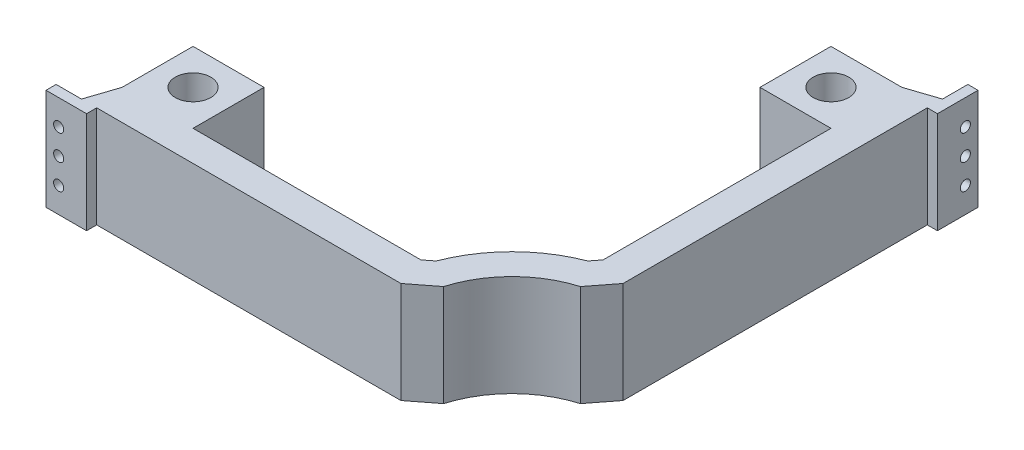
ISO-10303-21;
HEADER;
FILE_DESCRIPTION(('STEP AP214'),'2;1');
FILE_NAME('part.step','',(''),(''),'','','');
FILE_SCHEMA(('AUTOMOTIVE_DESIGN { 1 0 10303 214 1 1 1 1 }'));
ENDSEC;
DATA;
#1=APPLICATION_CONTEXT('core data for automotive mechanical design processes');
#2=APPLICATION_PROTOCOL_DEFINITION('international standard','automotive_design',2000,#1);
#3=PRODUCT_CONTEXT('',#1,'mechanical');
#4=PRODUCT('Part','Part','',(#3));
#5=PRODUCT_RELATED_PRODUCT_CATEGORY('part','',(#4));
#6=PRODUCT_DEFINITION_FORMATION('','',#4);
#7=PRODUCT_DEFINITION_CONTEXT('part definition',#1,'design');
#8=PRODUCT_DEFINITION('design','',#6,#7);
#9=PRODUCT_DEFINITION_SHAPE('','',#8);
#10=(LENGTH_UNIT() NAMED_UNIT(*) SI_UNIT(.MILLI.,.METRE.));
#11=(NAMED_UNIT(*) PLANE_ANGLE_UNIT() SI_UNIT($,.RADIAN.));
#12=(NAMED_UNIT(*) SI_UNIT($,.STERADIAN.) SOLID_ANGLE_UNIT());
#13=UNCERTAINTY_MEASURE_WITH_UNIT(LENGTH_MEASURE(1.E-05),#10,'distance_accuracy_value','');
#14=(GEOMETRIC_REPRESENTATION_CONTEXT(3) GLOBAL_UNCERTAINTY_ASSIGNED_CONTEXT((#13)) GLOBAL_UNIT_ASSIGNED_CONTEXT((#10,
#11,#12)) REPRESENTATION_CONTEXT('',''));
#15=CARTESIAN_POINT('',(0.,0.,0.));
#16=DIRECTION('',(0.,0.,1.));
#17=DIRECTION('',(1.,0.,0.));
#18=AXIS2_PLACEMENT_3D('',#15,#16,#17);
#19=CARTESIAN_POINT('',(75.2748115463517,50.,58.4534513140151));
#20=DIRECTION('',(0.789828047862948,0.,0.613328341762392));
#21=DIRECTION('',(0.613328341762392,0.,-0.789828047862948));
#22=AXIS2_PLACEMENT_3D('',#19,#20,#21);
#23=PLANE('',#22);
#24=DIRECTION('',(-0.613328341762392,0.,0.789828047862948));
#25=VECTOR('',#24,1.);
#26=CARTESIAN_POINT('',(75.2748115463517,0.,58.4534513140151));
#27=LINE('',#26,#25);
#28=CARTESIAN_POINT('',(87.3943284486439,0.,42.8462573785882));
#29=VERTEX_POINT('',#28);
#30=CARTESIAN_POINT('',(84.0957352305978,0.,47.0940986484323));
#31=VERTEX_POINT('',#30);
#32=EDGE_CURVE('E251',#29,#31,#27,.T.);
#33=ORIENTED_EDGE('',*,*,#32,.T.);
#34=DIRECTION('',(0.,-1.,0.));
#35=VECTOR('',#34,1.);
#36=CARTESIAN_POINT('',(84.0957352305978,50.,47.0940986484323));
#37=LINE('',#36,#35);
#38=CARTESIAN_POINT('',(84.0957352305978,50.,47.0940986484323));
#39=VERTEX_POINT('',#38);
#40=EDGE_CURVE('E11',#39,#31,#37,.T.);
#41=ORIENTED_EDGE('',*,*,#40,.F.);
#42=DIRECTION('',(-0.613328341762392,0.,0.789828047862948));
#43=VECTOR('',#42,1.);
#44=CARTESIAN_POINT('',(75.2748115463517,50.,58.4534513140151));
#45=LINE('',#44,#43);
#46=CARTESIAN_POINT('',(87.3943284486439,50.,42.8462573785882));
#47=VERTEX_POINT('',#46);
#48=EDGE_CURVE('E319',#47,#39,#45,.T.);
#49=ORIENTED_EDGE('',*,*,#48,.F.);
#50=DIRECTION('',(0.,-1.,0.));
#51=VECTOR('',#50,1.);
#52=CARTESIAN_POINT('',(87.3943284486439,50.,42.8462573785882));
#53=LINE('',#52,#51);
#54=EDGE_CURVE('E247',#47,#29,#53,.T.);
#55=ORIENTED_EDGE('',*,*,#54,.T.);
#56=EDGE_LOOP('',(#33,#41,#49,#55));
#57=FACE_BOUND('',#56,.T.);
#58=ADVANCED_FACE('F45',(#57),#23,.F.);
#59=CARTESIAN_POINT('',(107.394328448644,50.,107.775031024756));
#60=DIRECTION('',(0.,-1.,0.));
#61=DIRECTION('',(0.,0.,-1.));
#62=AXIS2_PLACEMENT_3D('',#59,#60,#61);
#63=CYLINDRICAL_SURFACE('',#62,65.);
#64=CARTESIAN_POINT('',(107.394328448644,0.,107.775031024756));
#65=DIRECTION('',(0.,1.,0.));
#66=DIRECTION('',(0.,0.,1.));
#67=AXIS2_PLACEMENT_3D('',#64,#65,#66);
#68=CIRCLE('',#67,65.);
#69=CARTESIAN_POINT('',(46.7133960723198,0.,84.4764378067104));
#70=VERTEX_POINT('',#69);
#71=EDGE_CURVE('E254',#31,#70,#68,.T.);
#72=ORIENTED_EDGE('',*,*,#71,.T.);
#73=DIRECTION('',(0.,-1.,0.));
#74=VECTOR('',#73,1.);
#75=CARTESIAN_POINT('',(46.7133960723198,50.,84.4764378067104));
#76=LINE('',#75,#74);
#77=CARTESIAN_POINT('',(46.7133960723198,50.,84.4764378067104));
#78=VERTEX_POINT('',#77);
#79=EDGE_CURVE('E54',#78,#70,#76,.T.);
#80=ORIENTED_EDGE('',*,*,#79,.F.);
#81=CARTESIAN_POINT('',(107.394328448644,50.,107.775031024756));
#82=DIRECTION('',(0.,1.,0.));
#83=DIRECTION('',(0.,0.,1.));
#84=AXIS2_PLACEMENT_3D('',#81,#82,#83);
#85=CIRCLE('',#84,65.);
#86=EDGE_CURVE('E160',#39,#78,#85,.T.);
#87=ORIENTED_EDGE('',*,*,#86,.F.);
#88=ORIENTED_EDGE('',*,*,#40,.T.);
#89=EDGE_LOOP('',(#72,#80,#87,#88));
#90=FACE_BOUND('',#89,.T.);
#91=ADVANCED_FACE('F465',(#90),#63,.T.);
#92=CARTESIAN_POINT('',(58.4946632328602,50.,75.3278831675267));
#93=DIRECTION('',(-0.613328341762393,0.,-0.789828047862947));
#94=DIRECTION('',(-0.789828047862947,0.,0.613328341762393));
#95=AXIS2_PLACEMENT_3D('',#92,#93,#94);
#96=PLANE('',#95);
#97=DIRECTION('',(0.789828047862947,0.,-0.613328341762393));
#98=VECTOR('',#97,1.);
#99=CARTESIAN_POINT('',(58.4946632328602,0.,75.3278831675267));
#100=LINE('',#99,#98);
#101=CARTESIAN_POINT('',(42.465554802476,0.,87.7750310247564));
#102=VERTEX_POINT('',#101);
#103=EDGE_CURVE('E258',#102,#70,#100,.T.);
#104=ORIENTED_EDGE('',*,*,#103,.F.);
#105=DIRECTION('',(0.,-1.,0.));
#106=VECTOR('',#105,1.);
#107=CARTESIAN_POINT('',(42.465554802476,50.,87.7750310247564));
#108=LINE('',#107,#106);
#109=CARTESIAN_POINT('',(42.465554802476,50.,87.7750310247564));
#110=VERTEX_POINT('',#109);
#111=EDGE_CURVE('E366',#110,#102,#108,.T.);
#112=ORIENTED_EDGE('',*,*,#111,.F.);
#113=DIRECTION('',(0.789828047862947,0.,-0.613328341762393));
#114=VECTOR('',#113,1.);
#115=CARTESIAN_POINT('',(58.4946632328602,50.,75.3278831675267));
#116=LINE('',#115,#114);
#117=EDGE_CURVE('E392',#110,#78,#116,.T.);
#118=ORIENTED_EDGE('',*,*,#117,.T.);
#119=ORIENTED_EDGE('',*,*,#79,.T.);
#120=EDGE_LOOP('',(#104,#112,#118,#119));
#121=FACE_BOUND('',#120,.T.);
#122=ADVANCED_FACE('F469',(#121),#96,.T.);
#123=CARTESIAN_POINT('',(0.,50.,87.7750310247564));
#124=DIRECTION('',(0.,0.,-1.));
#125=DIRECTION('',(-1.,0.,0.));
#126=AXIS2_PLACEMENT_3D('',#123,#124,#125);
#127=PLANE('',#126);
#128=DIRECTION('',(1.,0.,0.));
#129=VECTOR('',#128,1.);
#130=CARTESIAN_POINT('',(0.,0.,87.7750310247564));
#131=LINE('',#130,#129);
#132=CARTESIAN_POINT('',(-69.8943284486439,0.,87.7750310247564));
#133=VERTEX_POINT('',#132);
#134=EDGE_CURVE('E261',#133,#102,#131,.T.);
#135=ORIENTED_EDGE('',*,*,#134,.F.);
#136=DIRECTION('',(0.,-1.,0.));
#137=VECTOR('',#136,1.);
#138=CARTESIAN_POINT('',(-69.8943284486439,50.,87.7750310247564));
#139=LINE('',#138,#137);
#140=CARTESIAN_POINT('',(-69.8943284486439,50.,87.7750310247564));
#141=VERTEX_POINT('',#140);
#142=EDGE_CURVE('E364',#141,#133,#139,.T.);
#143=ORIENTED_EDGE('',*,*,#142,.F.);
#144=DIRECTION('',(1.,0.,0.));
#145=VECTOR('',#144,1.);
#146=CARTESIAN_POINT('',(0.,50.,87.7750310247564));
#147=LINE('',#146,#145);
#148=EDGE_CURVE('E395',#141,#110,#147,.T.);
#149=ORIENTED_EDGE('',*,*,#148,.T.);
#150=ORIENTED_EDGE('',*,*,#111,.T.);
#151=EDGE_LOOP('',(#135,#143,#149,#150));
#152=FACE_BOUND('',#151,.T.);
#153=ADVANCED_FACE('F473',(#152),#127,.T.);
#154=CARTESIAN_POINT('',(-69.894328448644,50.,0.));
#155=DIRECTION('',(1.,0.,0.));
#156=DIRECTION('',(0.,0.,-1.));
#157=AXIS2_PLACEMENT_3D('',#154,#155,#156);
#158=PLANE('',#157);
#159=DIRECTION('',(0.,0.,1.));
#160=VECTOR('',#159,1.);
#161=CARTESIAN_POINT('',(-69.894328448644,0.,0.));
#162=LINE('',#161,#160);
#163=CARTESIAN_POINT('',(-69.894328448644,0.,52.7750310247564));
#164=VERTEX_POINT('',#163);
#165=EDGE_CURVE('E264',#164,#133,#162,.T.);
#166=ORIENTED_EDGE('',*,*,#165,.F.);
#167=DIRECTION('',(0.,-1.,0.));
#168=VECTOR('',#167,1.);
#169=CARTESIAN_POINT('',(-69.894328448644,50.,52.7750310247564));
#170=LINE('',#169,#168);
#171=CARTESIAN_POINT('',(-69.894328448644,50.,52.7750310247564));
#172=VERTEX_POINT('',#171);
#173=EDGE_CURVE('E362',#172,#164,#170,.T.);
#174=ORIENTED_EDGE('',*,*,#173,.F.);
#175=DIRECTION('',(0.,0.,1.));
#176=VECTOR('',#175,1.);
#177=CARTESIAN_POINT('',(-69.894328448644,50.,0.));
#178=LINE('',#177,#176);
#179=EDGE_CURVE('E398',#172,#141,#178,.T.);
#180=ORIENTED_EDGE('',*,*,#179,.T.);
#181=ORIENTED_EDGE('',*,*,#142,.T.);
#182=EDGE_LOOP('',(#166,#174,#180,#181));
#183=FACE_BOUND('',#182,.T.);
#184=ADVANCED_FACE('F479',(#183),#158,.T.);
#185=CARTESIAN_POINT('',(0.,50.,52.7750310247564));
#186=DIRECTION('',(0.,0.,-1.));
#187=DIRECTION('',(-1.,0.,0.));
#188=AXIS2_PLACEMENT_3D('',#185,#186,#187);
#189=PLANE('',#188);
#190=DIRECTION('',(1.,0.,0.));
#191=VECTOR('',#190,1.);
#192=CARTESIAN_POINT('',(0.,0.,52.7750310247564));
#193=LINE('',#192,#191);
#194=CARTESIAN_POINT('',(-104.894328448644,0.,52.7750310247563));
#195=VERTEX_POINT('',#194);
#196=EDGE_CURVE('E267',#195,#164,#193,.T.);
#197=ORIENTED_EDGE('',*,*,#196,.F.);
#198=DIRECTION('',(0.,-1.,0.));
#199=VECTOR('',#198,1.);
#200=CARTESIAN_POINT('',(-104.894328448644,50.,52.7750310247563));
#201=LINE('',#200,#199);
#202=CARTESIAN_POINT('',(-104.894328448644,50.,52.7750310247563));
#203=VERTEX_POINT('',#202);
#204=EDGE_CURVE('E360',#203,#195,#201,.T.);
#205=ORIENTED_EDGE('',*,*,#204,.F.);
#206=DIRECTION('',(1.,0.,0.));
#207=VECTOR('',#206,1.);
#208=CARTESIAN_POINT('',(0.,50.,52.7750310247564));
#209=LINE('',#208,#207);
#210=EDGE_CURVE('E401',#203,#172,#209,.T.);
#211=ORIENTED_EDGE('',*,*,#210,.T.);
#212=ORIENTED_EDGE('',*,*,#173,.T.);
#213=EDGE_LOOP('',(#197,#205,#211,#212));
#214=FACE_BOUND('',#213,.T.);
#215=ADVANCED_FACE('F483',(#214),#189,.T.);
#216=CARTESIAN_POINT('',(-104.894328448644,50.,0.));
#217=DIRECTION('',(1.,0.,0.));
#218=DIRECTION('',(0.,0.,-1.));
#219=AXIS2_PLACEMENT_3D('',#216,#217,#218);
#220=PLANE('',#219);
#221=DIRECTION('',(0.,0.,1.));
#222=VECTOR('',#221,1.);
#223=CARTESIAN_POINT('',(-104.894328448644,0.,0.));
#224=LINE('',#223,#222);
#225=CARTESIAN_POINT('',(-104.894328448644,0.,87.7750310247563));
#226=VERTEX_POINT('',#225);
#227=EDGE_CURVE('E270',#195,#226,#224,.T.);
#228=ORIENTED_EDGE('',*,*,#227,.T.);
#229=DIRECTION('',(0.,-1.,0.));
#230=VECTOR('',#229,1.);
#231=CARTESIAN_POINT('',(-104.894328448644,50.,87.7750310247563));
#232=LINE('',#231,#230);
#233=CARTESIAN_POINT('',(-104.894328448644,50.,87.7750310247563));
#234=VERTEX_POINT('',#233);
#235=EDGE_CURVE('E357',#234,#226,#232,.T.);
#236=ORIENTED_EDGE('',*,*,#235,.F.);
#237=DIRECTION('',(0.,0.,1.));
#238=VECTOR('',#237,1.);
#239=CARTESIAN_POINT('',(-104.894328448644,50.,0.));
#240=LINE('',#239,#238);
#241=EDGE_CURVE('E404',#203,#234,#240,.T.);
#242=ORIENTED_EDGE('',*,*,#241,.F.);
#243=ORIENTED_EDGE('',*,*,#204,.T.);
#244=EDGE_LOOP('',(#228,#236,#242,#243));
#245=FACE_BOUND('',#244,.T.);
#246=ADVANCED_FACE('F487',(#245),#220,.F.);
#247=CARTESIAN_POINT('',(-68.0723862963527,50.,-22.6907954321175));
#248=DIRECTION('',(0.948683298050514,0.,0.316227766016838));
#249=DIRECTION('',(0.316227766016838,0.,-0.948683298050514));
#250=AXIS2_PLACEMENT_3D('',#247,#248,#249);
#251=PLANE('',#250);
#252=DIRECTION('',(-0.316227766016838,0.,0.948683298050514));
#253=VECTOR('',#252,1.);
#254=CARTESIAN_POINT('',(-68.0723862963527,0.,-22.6907954321175));
#255=LINE('',#254,#253);
#256=CARTESIAN_POINT('',(-109.894328448644,0.,102.775031024756));
#257=VERTEX_POINT('',#256);
#258=EDGE_CURVE('E272',#226,#257,#255,.T.);
#259=ORIENTED_EDGE('',*,*,#258,.T.);
#260=DIRECTION('',(0.,-1.,0.));
#261=VECTOR('',#260,1.);
#262=CARTESIAN_POINT('',(-109.894328448644,50.,102.775031024756));
#263=LINE('',#262,#261);
#264=CARTESIAN_POINT('',(-109.894328448644,50.,102.775031024756));
#265=VERTEX_POINT('',#264);
#266=EDGE_CURVE('E355',#265,#257,#263,.T.);
#267=ORIENTED_EDGE('',*,*,#266,.F.);
#268=DIRECTION('',(-0.316227766016838,0.,0.948683298050514));
#269=VECTOR('',#268,1.);
#270=CARTESIAN_POINT('',(-68.0723862963527,50.,-22.6907954321175));
#271=LINE('',#270,#269);
#272=EDGE_CURVE('E406',#234,#265,#271,.T.);
#273=ORIENTED_EDGE('',*,*,#272,.F.);
#274=ORIENTED_EDGE('',*,*,#235,.T.);
#275=EDGE_LOOP('',(#259,#267,#273,#274));
#276=FACE_BOUND('',#275,.T.);
#277=ADVANCED_FACE('F491',(#276),#251,.F.);
#278=CARTESIAN_POINT('',(0.,50.,102.775031024756));
#279=DIRECTION('',(0.,0.,-1.));
#280=DIRECTION('',(-1.,0.,0.));
#281=AXIS2_PLACEMENT_3D('',#278,#279,#280);
#282=PLANE('',#281);
#283=CARTESIAN_POINT('',(-116.144328448644,37.5,102.775031024756));
#284=DIRECTION('',(0.,0.,-1.));
#285=DIRECTION('',(-1.,0.,0.));
#286=AXIS2_PLACEMENT_3D('',#283,#284,#285);
#287=CIRCLE('',#286,2.5);
#288=CARTESIAN_POINT('',(-118.644328448644,37.5,102.775031024756));
#289=VERTEX_POINT('',#288);
#290=EDGE_CURVE('E372',#289,#289,#287,.T.);
#291=ORIENTED_EDGE('',*,*,#290,.F.);
#292=EDGE_LOOP('',(#291));
#293=FACE_BOUND('',#292,.T.);
#294=CARTESIAN_POINT('',(-116.144328448644,25.,102.775031024756));
#295=DIRECTION('',(0.,0.,-1.));
#296=DIRECTION('',(-1.,0.,0.));
#297=AXIS2_PLACEMENT_3D('',#294,#295,#296);
#298=CIRCLE('',#297,2.5);
#299=CARTESIAN_POINT('',(-118.644328448644,25.,102.775031024756));
#300=VERTEX_POINT('',#299);
#301=EDGE_CURVE('E675',#300,#300,#298,.T.);
#302=ORIENTED_EDGE('',*,*,#301,.F.);
#303=EDGE_LOOP('',(#302));
#304=FACE_BOUND('',#303,.T.);
#305=CARTESIAN_POINT('',(-116.144328448644,12.5,102.775031024756));
#306=DIRECTION('',(0.,0.,-1.));
#307=DIRECTION('',(-1.,0.,0.));
#308=AXIS2_PLACEMENT_3D('',#305,#306,#307);
#309=CIRCLE('',#308,2.5);
#310=CARTESIAN_POINT('',(-118.644328448644,12.5,102.775031024756));
#311=VERTEX_POINT('',#310);
#312=EDGE_CURVE('E671',#311,#311,#309,.T.);
#313=ORIENTED_EDGE('',*,*,#312,.F.);
#314=EDGE_LOOP('',(#313));
#315=FACE_BOUND('',#314,.T.);
#316=DIRECTION('',(1.,0.,0.));
#317=VECTOR('',#316,1.);
#318=CARTESIAN_POINT('',(0.,0.,102.775031024756));
#319=LINE('',#318,#317);
#320=CARTESIAN_POINT('',(-122.394328448644,0.,102.775031024756));
#321=VERTEX_POINT('',#320);
#322=EDGE_CURVE('E275',#321,#257,#319,.T.);
#323=ORIENTED_EDGE('',*,*,#322,.F.);
#324=DIRECTION('',(0.,-1.,0.));
#325=VECTOR('',#324,1.);
#326=CARTESIAN_POINT('',(-122.394328448644,50.,102.775031024756));
#327=LINE('',#326,#325);
#328=CARTESIAN_POINT('',(-122.394328448644,50.,102.775031024756));
#329=VERTEX_POINT('',#328);
#330=EDGE_CURVE('E353',#329,#321,#327,.T.);
#331=ORIENTED_EDGE('',*,*,#330,.F.);
#332=DIRECTION('',(1.,0.,0.));
#333=VECTOR('',#332,1.);
#334=CARTESIAN_POINT('',(0.,50.,102.775031024756));
#335=LINE('',#334,#333);
#336=EDGE_CURVE('E408',#329,#265,#335,.T.);
#337=ORIENTED_EDGE('',*,*,#336,.T.);
#338=ORIENTED_EDGE('',*,*,#266,.T.);
#339=EDGE_LOOP('',(#323,#331,#337,#338));
#340=FACE_BOUND('',#339,.T.);
#341=ADVANCED_FACE('F495',(#293,#304,#315,#340),#282,.T.);
#342=CARTESIAN_POINT('',(-122.394328448644,50.,0.));
#343=DIRECTION('',(-1.,0.,0.));
#344=DIRECTION('',(0.,0.,1.));
#345=AXIS2_PLACEMENT_3D('',#342,#343,#344);
#346=PLANE('',#345);
#347=DIRECTION('',(0.,0.,-1.));
#348=VECTOR('',#347,1.);
#349=CARTESIAN_POINT('',(-122.394328448644,0.,0.));
#350=LINE('',#349,#348);
#351=CARTESIAN_POINT('',(-122.394328448644,0.,107.775031024756));
#352=VERTEX_POINT('',#351);
#353=EDGE_CURVE('E278',#352,#321,#350,.T.);
#354=ORIENTED_EDGE('',*,*,#353,.F.);
#355=DIRECTION('',(0.,-1.,0.));
#356=VECTOR('',#355,1.);
#357=CARTESIAN_POINT('',(-122.394328448644,50.,107.775031024756));
#358=LINE('',#357,#356);
#359=CARTESIAN_POINT('',(-122.394328448644,50.,107.775031024756));
#360=VERTEX_POINT('',#359);
#361=EDGE_CURVE('E351',#360,#352,#358,.T.);
#362=ORIENTED_EDGE('',*,*,#361,.F.);
#363=DIRECTION('',(0.,0.,-1.));
#364=VECTOR('',#363,1.);
#365=CARTESIAN_POINT('',(-122.394328448644,50.,0.));
#366=LINE('',#365,#364);
#367=EDGE_CURVE('E411',#360,#329,#366,.T.);
#368=ORIENTED_EDGE('',*,*,#367,.T.);
#369=ORIENTED_EDGE('',*,*,#330,.T.);
#370=EDGE_LOOP('',(#354,#362,#368,#369));
#371=FACE_BOUND('',#370,.T.);
#372=ADVANCED_FACE('F499',(#371),#346,.T.);
#373=CARTESIAN_POINT('',(0.,50.,107.775031024756));
#374=DIRECTION('',(0.,0.,1.));
#375=DIRECTION('',(1.,0.,0.));
#376=AXIS2_PLACEMENT_3D('',#373,#374,#375);
#377=PLANE('',#376);
#378=CARTESIAN_POINT('',(-116.144328448644,37.5,107.775031024756));
#379=DIRECTION('',(0.,0.,1.));
#380=DIRECTION('',(1.,0.,0.));
#381=AXIS2_PLACEMENT_3D('',#378,#379,#380);
#382=CIRCLE('',#381,2.5);
#383=CARTESIAN_POINT('',(-113.644328448644,37.5,107.775031024756));
#384=VERTEX_POINT('',#383);
#385=EDGE_CURVE('E48',#384,#384,#382,.T.);
#386=ORIENTED_EDGE('',*,*,#385,.F.);
#387=EDGE_LOOP('',(#386));
#388=FACE_BOUND('',#387,.T.);
#389=CARTESIAN_POINT('',(-116.144328448644,25.,107.775031024756));
#390=DIRECTION('',(0.,0.,1.));
#391=DIRECTION('',(1.,0.,0.));
#392=AXIS2_PLACEMENT_3D('',#389,#390,#391);
#393=CIRCLE('',#392,2.5);
#394=CARTESIAN_POINT('',(-113.644328448644,25.,107.775031024756));
#395=VERTEX_POINT('',#394);
#396=EDGE_CURVE('E371',#395,#395,#393,.T.);
#397=ORIENTED_EDGE('',*,*,#396,.F.);
#398=EDGE_LOOP('',(#397));
#399=FACE_BOUND('',#398,.T.);
#400=CARTESIAN_POINT('',(-116.144328448644,12.5,107.775031024756));
#401=DIRECTION('',(0.,0.,1.));
#402=DIRECTION('',(1.,0.,0.));
#403=AXIS2_PLACEMENT_3D('',#400,#401,#402);
#404=CIRCLE('',#403,2.5);
#405=CARTESIAN_POINT('',(-113.644328448644,12.5,107.775031024756));
#406=VERTEX_POINT('',#405);
#407=EDGE_CURVE('E369',#406,#406,#404,.T.);
#408=ORIENTED_EDGE('',*,*,#407,.F.);
#409=EDGE_LOOP('',(#408));
#410=FACE_BOUND('',#409,.T.);
#411=DIRECTION('',(-1.,0.,0.));
#412=VECTOR('',#411,1.);
#413=CARTESIAN_POINT('',(0.,0.,107.775031024756));
#414=LINE('',#413,#412);
#415=CARTESIAN_POINT('',(-102.394328448644,0.,107.775031024756));
#416=VERTEX_POINT('',#415);
#417=EDGE_CURVE('E281',#416,#352,#414,.T.);
#418=ORIENTED_EDGE('',*,*,#417,.F.);
#419=DIRECTION('',(0.,-1.,0.));
#420=VECTOR('',#419,1.);
#421=CARTESIAN_POINT('',(-102.394328448644,50.,107.775031024756));
#422=LINE('',#421,#420);
#423=CARTESIAN_POINT('',(-102.394328448644,50.,107.775031024756));
#424=VERTEX_POINT('',#423);
#425=EDGE_CURVE('E349',#424,#416,#422,.T.);
#426=ORIENTED_EDGE('',*,*,#425,.F.);
#427=DIRECTION('',(-1.,0.,0.));
#428=VECTOR('',#427,1.);
#429=CARTESIAN_POINT('',(0.,50.,107.775031024756));
#430=LINE('',#429,#428);
#431=EDGE_CURVE('E414',#424,#360,#430,.T.);
#432=ORIENTED_EDGE('',*,*,#431,.T.);
#433=ORIENTED_EDGE('',*,*,#361,.T.);
#434=EDGE_LOOP('',(#418,#426,#432,#433));
#435=FACE_BOUND('',#434,.T.);
#436=ADVANCED_FACE('F503',(#388,#399,#410,#435),#377,.T.);
#437=CARTESIAN_POINT('',(-102.394328448644,50.,0.));
#438=DIRECTION('',(1.,0.,0.));
#439=DIRECTION('',(0.,0.,-1.));
#440=AXIS2_PLACEMENT_3D('',#437,#438,#439);
#441=PLANE('',#440);
#442=DIRECTION('',(0.,0.,1.));
#443=VECTOR('',#442,1.);
#444=CARTESIAN_POINT('',(-102.394328448644,0.,0.));
#445=LINE('',#444,#443);
#446=CARTESIAN_POINT('',(-102.394328448644,0.,102.775031024756));
#447=VERTEX_POINT('',#446);
#448=EDGE_CURVE('E284',#447,#416,#445,.T.);
#449=ORIENTED_EDGE('',*,*,#448,.F.);
#450=DIRECTION('',(0.,-1.,0.));
#451=VECTOR('',#450,1.);
#452=CARTESIAN_POINT('',(-102.394328448644,50.,102.775031024756));
#453=LINE('',#452,#451);
#454=CARTESIAN_POINT('',(-102.394328448644,50.,102.775031024756));
#455=VERTEX_POINT('',#454);
#456=EDGE_CURVE('E347',#455,#447,#453,.T.);
#457=ORIENTED_EDGE('',*,*,#456,.F.);
#458=DIRECTION('',(0.,0.,1.));
#459=VECTOR('',#458,1.);
#460=CARTESIAN_POINT('',(-102.394328448644,50.,0.));
#461=LINE('',#460,#459);
#462=EDGE_CURVE('E417',#455,#424,#461,.T.);
#463=ORIENTED_EDGE('',*,*,#462,.T.);
#464=ORIENTED_EDGE('',*,*,#425,.T.);
#465=EDGE_LOOP('',(#449,#457,#463,#464));
#466=FACE_BOUND('',#465,.T.);
#467=ADVANCED_FACE('F507',(#466),#441,.T.);
#468=CARTESIAN_POINT('',(0.,50.,102.775031024756));
#469=DIRECTION('',(0.,0.,-1.));
#470=DIRECTION('',(-1.,0.,0.));
#471=AXIS2_PLACEMENT_3D('',#468,#469,#470);
#472=PLANE('',#471);
#473=DIRECTION('',(1.,0.,0.));
#474=VECTOR('',#473,1.);
#475=CARTESIAN_POINT('',(0.,0.,102.775031024756));
#476=LINE('',#475,#474);
#477=CARTESIAN_POINT('',(47.605671551356,0.,102.775031024756));
#478=VERTEX_POINT('',#477);
#479=EDGE_CURVE('E287',#447,#478,#476,.T.);
#480=ORIENTED_EDGE('',*,*,#479,.T.);
#481=DIRECTION('',(0.,-1.,0.));
#482=VECTOR('',#481,1.);
#483=CARTESIAN_POINT('',(47.605671551356,50.,102.775031024756));
#484=LINE('',#483,#482);
#485=CARTESIAN_POINT('',(47.605671551356,50.,102.775031024756));
#486=VERTEX_POINT('',#485);
#487=EDGE_CURVE('E344',#486,#478,#484,.T.);
#488=ORIENTED_EDGE('',*,*,#487,.F.);
#489=DIRECTION('',(1.,0.,0.));
#490=VECTOR('',#489,1.);
#491=CARTESIAN_POINT('',(0.,50.,102.775031024756));
#492=LINE('',#491,#490);
#493=EDGE_CURVE('E420',#455,#486,#492,.T.);
#494=ORIENTED_EDGE('',*,*,#493,.F.);
#495=ORIENTED_EDGE('',*,*,#456,.T.);
#496=EDGE_LOOP('',(#480,#488,#494,#495));
#497=FACE_BOUND('',#496,.T.);
#498=ADVANCED_FACE('F511',(#497),#472,.F.);
#499=CARTESIAN_POINT('',(67.6945883592959,50.,87.1753038854709));
#500=DIRECTION('',(-0.613328341762392,0.,-0.789828047862947));
#501=DIRECTION('',(-0.789828047862947,0.,0.613328341762392));
#502=AXIS2_PLACEMENT_3D('',#499,#500,#501);
#503=PLANE('',#502);
#504=DIRECTION('',(0.789828047862947,0.,-0.613328341762392));
#505=VECTOR('',#504,1.);
#506=CARTESIAN_POINT('',(67.6945883592959,0.,87.1753038854709));
#507=LINE('',#506,#505);
#508=CARTESIAN_POINT('',(59.4530922693003,0.,93.5751058983204));
#509=VERTEX_POINT('',#508);
#510=EDGE_CURVE('E289',#478,#509,#507,.T.);
#511=ORIENTED_EDGE('',*,*,#510,.T.);
#512=DIRECTION('',(0.,-1.,0.));
#513=VECTOR('',#512,1.);
#514=CARTESIAN_POINT('',(59.4530922693003,50.,93.5751058983204));
#515=LINE('',#514,#513);
#516=CARTESIAN_POINT('',(59.4530922693003,50.,93.5751058983204));
#517=VERTEX_POINT('',#516);
#518=EDGE_CURVE('E342',#517,#509,#515,.T.);
#519=ORIENTED_EDGE('',*,*,#518,.F.);
#520=DIRECTION('',(0.789828047862947,0.,-0.613328341762392));
#521=VECTOR('',#520,1.);
#522=CARTESIAN_POINT('',(67.6945883592959,50.,87.1753038854709));
#523=LINE('',#522,#521);
#524=EDGE_CURVE('E422',#486,#517,#523,.T.);
#525=ORIENTED_EDGE('',*,*,#524,.F.);
#526=ORIENTED_EDGE('',*,*,#487,.T.);
#527=EDGE_LOOP('',(#511,#519,#525,#526));
#528=FACE_BOUND('',#527,.T.);
#529=ADVANCED_FACE('F515',(#528),#503,.F.);
#530=CARTESIAN_POINT('',(107.394328448644,50.,107.775031024756));
#531=DIRECTION('',(0.,-1.,0.));
#532=DIRECTION('',(0.,0.,-1.));
#533=AXIS2_PLACEMENT_3D('',#530,#531,#532);
#534=CYLINDRICAL_SURFACE('',#533,50.);
#535=CARTESIAN_POINT('',(107.394328448644,0.,107.775031024756));
#536=DIRECTION('',(0.,1.,0.));
#537=DIRECTION('',(0.,0.,1.));
#538=AXIS2_PLACEMENT_3D('',#535,#536,#537);
#539=CIRCLE('',#538,50.);
#540=CARTESIAN_POINT('',(93.1944033222081,0.,59.8337948454126));
#541=VERTEX_POINT('',#540);
#542=EDGE_CURVE('E292',#541,#509,#539,.T.);
#543=ORIENTED_EDGE('',*,*,#542,.F.);
#544=DIRECTION('',(0.,-1.,0.));
#545=VECTOR('',#544,1.);
#546=CARTESIAN_POINT('',(93.1944033222081,50.,59.8337948454126));
#547=LINE('',#546,#545);
#548=CARTESIAN_POINT('',(93.1944033222081,50.,59.8337948454126));
#549=VERTEX_POINT('',#548);
#550=EDGE_CURVE('E340',#549,#541,#547,.T.);
#551=ORIENTED_EDGE('',*,*,#550,.F.);
#552=CARTESIAN_POINT('',(107.394328448644,50.,107.775031024756));
#553=DIRECTION('',(0.,1.,0.));
#554=DIRECTION('',(0.,0.,1.));
#555=AXIS2_PLACEMENT_3D('',#552,#553,#554);
#556=CIRCLE('',#555,50.);
#557=EDGE_CURVE('E424',#549,#517,#556,.T.);
#558=ORIENTED_EDGE('',*,*,#557,.T.);
#559=ORIENTED_EDGE('',*,*,#518,.T.);
#560=EDGE_LOOP('',(#543,#551,#558,#559));
#561=FACE_BOUND('',#560,.T.);
#562=ADVANCED_FACE('F519',(#561),#534,.F.);
#563=CARTESIAN_POINT('',(87.1222322642958,50.,67.6533764404512));
#564=DIRECTION('',(0.789828047862947,0.,0.613328341762393));
#565=DIRECTION('',(0.613328341762393,0.,-0.789828047862947));
#566=AXIS2_PLACEMENT_3D('',#563,#564,#565);
#567=PLANE('',#566);
#568=DIRECTION('',(-0.613328341762393,0.,0.789828047862947));
#569=VECTOR('',#568,1.);
#570=CARTESIAN_POINT('',(87.1222322642958,0.,67.6533764404512));
#571=LINE('',#570,#569);
#572=CARTESIAN_POINT('',(102.394328448644,0.,47.9863741274684));
#573=VERTEX_POINT('',#572);
#574=EDGE_CURVE('E295',#573,#541,#571,.T.);
#575=ORIENTED_EDGE('',*,*,#574,.F.);
#576=DIRECTION('',(0.,-1.,0.));
#577=VECTOR('',#576,1.);
#578=CARTESIAN_POINT('',(102.394328448644,50.,47.9863741274684));
#579=LINE('',#578,#577);
#580=CARTESIAN_POINT('',(102.394328448644,50.,47.9863741274684));
#581=VERTEX_POINT('',#580);
#582=EDGE_CURVE('E338',#581,#573,#579,.T.);
#583=ORIENTED_EDGE('',*,*,#582,.F.);
#584=DIRECTION('',(-0.613328341762393,0.,0.789828047862947));
#585=VECTOR('',#584,1.);
#586=CARTESIAN_POINT('',(87.1222322642958,50.,67.6533764404512));
#587=LINE('',#586,#585);
#588=EDGE_CURVE('E427',#581,#549,#587,.T.);
#589=ORIENTED_EDGE('',*,*,#588,.T.);
#590=ORIENTED_EDGE('',*,*,#550,.T.);
#591=EDGE_LOOP('',(#575,#583,#589,#590));
#592=FACE_BOUND('',#591,.T.);
#593=ADVANCED_FACE('F523',(#592),#567,.T.);
#594=CARTESIAN_POINT('',(102.394328448644,50.,0.));
#595=DIRECTION('',(1.,0.,0.));
#596=DIRECTION('',(0.,0.,-1.));
#597=AXIS2_PLACEMENT_3D('',#594,#595,#596);
#598=PLANE('',#597);
#599=DIRECTION('',(0.,0.,1.));
#600=VECTOR('',#599,1.);
#601=CARTESIAN_POINT('',(102.394328448644,0.,0.));
#602=LINE('',#601,#600);
#603=CARTESIAN_POINT('',(102.394328448644,0.,-102.013625872532));
#604=VERTEX_POINT('',#603);
#605=EDGE_CURVE('E298',#604,#573,#602,.T.);
#606=ORIENTED_EDGE('',*,*,#605,.F.);
#607=DIRECTION('',(0.,-1.,0.));
#608=VECTOR('',#607,1.);
#609=CARTESIAN_POINT('',(102.394328448644,50.,-102.013625872532));
#610=LINE('',#609,#608);
#611=CARTESIAN_POINT('',(102.394328448644,50.,-102.013625872532));
#612=VERTEX_POINT('',#611);
#613=EDGE_CURVE('E336',#612,#604,#610,.T.);
#614=ORIENTED_EDGE('',*,*,#613,.F.);
#615=DIRECTION('',(0.,0.,1.));
#616=VECTOR('',#615,1.);
#617=CARTESIAN_POINT('',(102.394328448644,50.,0.));
#618=LINE('',#617,#616);
#619=EDGE_CURVE('E430',#612,#581,#618,.T.);
#620=ORIENTED_EDGE('',*,*,#619,.T.);
#621=ORIENTED_EDGE('',*,*,#582,.T.);
#622=EDGE_LOOP('',(#606,#614,#620,#621));
#623=FACE_BOUND('',#622,.T.);
#624=ADVANCED_FACE('F527',(#623),#598,.T.);
#625=CARTESIAN_POINT('',(0.,50.,-102.013625872532));
#626=DIRECTION('',(0.,0.,-1.));
#627=DIRECTION('',(-1.,0.,0.));
#628=AXIS2_PLACEMENT_3D('',#625,#626,#627);
#629=PLANE('',#628);
#630=DIRECTION('',(1.,0.,0.));
#631=VECTOR('',#630,1.);
#632=CARTESIAN_POINT('',(0.,0.,-102.013625872532));
#633=LINE('',#632,#631);
#634=CARTESIAN_POINT('',(107.394328448644,0.,-102.013625872532));
#635=VERTEX_POINT('',#634);
#636=EDGE_CURVE('E301',#604,#635,#633,.T.);
#637=ORIENTED_EDGE('',*,*,#636,.T.);
#638=DIRECTION('',(0.,-1.,0.));
#639=VECTOR('',#638,1.);
#640=CARTESIAN_POINT('',(107.394328448644,50.,-102.013625872532));
#641=LINE('',#640,#639);
#642=CARTESIAN_POINT('',(107.394328448644,50.,-102.013625872532));
#643=VERTEX_POINT('',#642);
#644=EDGE_CURVE('E333',#643,#635,#641,.T.);
#645=ORIENTED_EDGE('',*,*,#644,.F.);
#646=DIRECTION('',(1.,0.,0.));
#647=VECTOR('',#646,1.);
#648=CARTESIAN_POINT('',(0.,50.,-102.013625872532));
#649=LINE('',#648,#647);
#650=EDGE_CURVE('E433',#612,#643,#649,.T.);
#651=ORIENTED_EDGE('',*,*,#650,.F.);
#652=ORIENTED_EDGE('',*,*,#613,.T.);
#653=EDGE_LOOP('',(#637,#645,#651,#652));
#654=FACE_BOUND('',#653,.T.);
#655=ADVANCED_FACE('F531',(#654),#629,.F.);
#656=CARTESIAN_POINT('',(107.394328448644,50.,0.));
#657=DIRECTION('',(-1.,0.,0.));
#658=DIRECTION('',(0.,0.,1.));
#659=AXIS2_PLACEMENT_3D('',#656,#657,#658);
#660=PLANE('',#659);
#661=CARTESIAN_POINT('',(107.394328448644,37.5,-115.763625872532));
#662=DIRECTION('',(-1.,0.,0.));
#663=DIRECTION('',(0.,0.,1.));
#664=AXIS2_PLACEMENT_3D('',#661,#662,#663);
#665=CIRCLE('',#664,2.5);
#666=CARTESIAN_POINT('',(107.394328448644,37.5,-113.263625872532));
#667=VERTEX_POINT('',#666);
#668=EDGE_CURVE('E670',#667,#667,#665,.T.);
#669=ORIENTED_EDGE('',*,*,#668,.T.);
#670=EDGE_LOOP('',(#669));
#671=FACE_BOUND('',#670,.T.);
#672=CARTESIAN_POINT('',(107.394328448644,25.,-115.763625872532));
#673=DIRECTION('',(-1.,0.,0.));
#674=DIRECTION('',(0.,0.,1.));
#675=AXIS2_PLACEMENT_3D('',#672,#673,#674);
#676=CIRCLE('',#675,2.5);
#677=CARTESIAN_POINT('',(107.394328448644,25.,-113.263625872532));
#678=VERTEX_POINT('',#677);
#679=EDGE_CURVE('E672',#678,#678,#676,.T.);
#680=ORIENTED_EDGE('',*,*,#679,.T.);
#681=EDGE_LOOP('',(#680));
#682=FACE_BOUND('',#681,.T.);
#683=CARTESIAN_POINT('',(107.394328448644,12.5,-115.763625872532));
#684=DIRECTION('',(-1.,0.,0.));
#685=DIRECTION('',(0.,0.,1.));
#686=AXIS2_PLACEMENT_3D('',#683,#684,#685);
#687=CIRCLE('',#686,2.5);
#688=CARTESIAN_POINT('',(107.394328448644,12.5,-113.263625872532));
#689=VERTEX_POINT('',#688);
#690=EDGE_CURVE('E678',#689,#689,#687,.T.);
#691=ORIENTED_EDGE('',*,*,#690,.T.);
#692=EDGE_LOOP('',(#691));
#693=FACE_BOUND('',#692,.T.);
#694=DIRECTION('',(0.,0.,-1.));
#695=VECTOR('',#694,1.);
#696=CARTESIAN_POINT('',(107.394328448644,0.,0.));
#697=LINE('',#696,#695);
#698=CARTESIAN_POINT('',(107.394328448644,0.,-122.013625872532));
#699=VERTEX_POINT('',#698);
#700=EDGE_CURVE('E303',#635,#699,#697,.T.);
#701=ORIENTED_EDGE('',*,*,#700,.T.);
#702=DIRECTION('',(0.,-1.,0.));
#703=VECTOR('',#702,1.);
#704=CARTESIAN_POINT('',(107.394328448644,50.,-122.013625872532));
#705=LINE('',#704,#703);
#706=CARTESIAN_POINT('',(107.394328448644,50.,-122.013625872532));
#707=VERTEX_POINT('',#706);
#708=EDGE_CURVE('E330',#707,#699,#705,.T.);
#709=ORIENTED_EDGE('',*,*,#708,.F.);
#710=DIRECTION('',(0.,0.,-1.));
#711=VECTOR('',#710,1.);
#712=CARTESIAN_POINT('',(107.394328448644,50.,0.));
#713=LINE('',#712,#711);
#714=EDGE_CURVE('E435',#643,#707,#713,.T.);
#715=ORIENTED_EDGE('',*,*,#714,.F.);
#716=ORIENTED_EDGE('',*,*,#644,.T.);
#717=EDGE_LOOP('',(#701,#709,#715,#716));
#718=FACE_BOUND('',#717,.T.);
#719=ADVANCED_FACE('F535',(#671,#682,#693,#718),#660,.F.);
#720=CARTESIAN_POINT('',(0.,50.,-122.013625872532));
#721=DIRECTION('',(0.,0.,1.));
#722=DIRECTION('',(1.,0.,0.));
#723=AXIS2_PLACEMENT_3D('',#720,#721,#722);
#724=PLANE('',#723);
#725=DIRECTION('',(-1.,0.,0.));
#726=VECTOR('',#725,1.);
#727=CARTESIAN_POINT('',(0.,0.,-122.013625872532));
#728=LINE('',#727,#726);
#729=CARTESIAN_POINT('',(102.394328448644,0.,-122.013625872532));
#730=VERTEX_POINT('',#729);
#731=EDGE_CURVE('E305',#699,#730,#728,.T.);
#732=ORIENTED_EDGE('',*,*,#731,.T.);
#733=DIRECTION('',(0.,-1.,0.));
#734=VECTOR('',#733,1.);
#735=CARTESIAN_POINT('',(102.394328448644,50.,-122.013625872532));
#736=LINE('',#735,#734);
#737=CARTESIAN_POINT('',(102.394328448644,50.,-122.013625872532));
#738=VERTEX_POINT('',#737);
#739=EDGE_CURVE('E327',#738,#730,#736,.T.);
#740=ORIENTED_EDGE('',*,*,#739,.F.);
#741=DIRECTION('',(-1.,0.,0.));
#742=VECTOR('',#741,1.);
#743=CARTESIAN_POINT('',(0.,50.,-122.013625872532));
#744=LINE('',#743,#742);
#745=EDGE_CURVE('E437',#707,#738,#744,.T.);
#746=ORIENTED_EDGE('',*,*,#745,.F.);
#747=ORIENTED_EDGE('',*,*,#708,.T.);
#748=EDGE_LOOP('',(#732,#740,#746,#747));
#749=FACE_BOUND('',#748,.T.);
#750=ADVANCED_FACE('F539',(#749),#724,.F.);
#751=CARTESIAN_POINT('',(102.394328448644,50.,0.));
#752=DIRECTION('',(1.,0.,0.));
#753=DIRECTION('',(0.,0.,-1.));
#754=AXIS2_PLACEMENT_3D('',#751,#752,#753);
#755=PLANE('',#754);
#756=CARTESIAN_POINT('',(102.394328448644,37.5,-115.763625872532));
#757=DIRECTION('',(-1.,0.,0.));
#758=DIRECTION('',(0.,0.,1.));
#759=AXIS2_PLACEMENT_3D('',#756,#757,#758);
#760=CIRCLE('',#759,2.5);
#761=CARTESIAN_POINT('',(102.394328448644,37.5,-113.263625872532));
#762=VERTEX_POINT('',#761);
#763=EDGE_CURVE('E667',#762,#762,#760,.T.);
#764=ORIENTED_EDGE('',*,*,#763,.F.);
#765=EDGE_LOOP('',(#764));
#766=FACE_BOUND('',#765,.T.);
#767=CARTESIAN_POINT('',(102.394328448644,25.,-115.763625872532));
#768=DIRECTION('',(-1.,0.,0.));
#769=DIRECTION('',(0.,0.,1.));
#770=AXIS2_PLACEMENT_3D('',#767,#768,#769);
#771=CIRCLE('',#770,2.5);
#772=CARTESIAN_POINT('',(102.394328448644,25.,-113.263625872532));
#773=VERTEX_POINT('',#772);
#774=EDGE_CURVE('E757',#773,#773,#771,.T.);
#775=ORIENTED_EDGE('',*,*,#774,.F.);
#776=EDGE_LOOP('',(#775));
#777=FACE_BOUND('',#776,.T.);
#778=CARTESIAN_POINT('',(102.394328448644,12.5,-115.763625872532));
#779=DIRECTION('',(-1.,0.,0.));
#780=DIRECTION('',(0.,0.,1.));
#781=AXIS2_PLACEMENT_3D('',#778,#779,#780);
#782=CIRCLE('',#781,2.5);
#783=CARTESIAN_POINT('',(102.394328448644,12.5,-113.263625872532));
#784=VERTEX_POINT('',#783);
#785=EDGE_CURVE('E754',#784,#784,#782,.T.);
#786=ORIENTED_EDGE('',*,*,#785,.F.);
#787=EDGE_LOOP('',(#786));
#788=FACE_BOUND('',#787,.T.);
#789=DIRECTION('',(0.,0.,1.));
#790=VECTOR('',#789,1.);
#791=CARTESIAN_POINT('',(102.394328448644,0.,0.));
#792=LINE('',#791,#790);
#793=CARTESIAN_POINT('',(102.394328448644,0.,-109.513625872532));
#794=VERTEX_POINT('',#793);
#795=EDGE_CURVE('E307',#730,#794,#792,.T.);
#796=ORIENTED_EDGE('',*,*,#795,.T.);
#797=DIRECTION('',(0.,-1.,0.));
#798=VECTOR('',#797,1.);
#799=CARTESIAN_POINT('',(102.394328448644,50.,-109.513625872532));
#800=LINE('',#799,#798);
#801=CARTESIAN_POINT('',(102.394328448644,50.,-109.513625872532));
#802=VERTEX_POINT('',#801);
#803=EDGE_CURVE('E325',#802,#794,#800,.T.);
#804=ORIENTED_EDGE('',*,*,#803,.F.);
#805=DIRECTION('',(0.,0.,1.));
#806=VECTOR('',#805,1.);
#807=CARTESIAN_POINT('',(102.394328448644,50.,0.));
#808=LINE('',#807,#806);
#809=EDGE_CURVE('E439',#738,#802,#808,.T.);
#810=ORIENTED_EDGE('',*,*,#809,.F.);
#811=ORIENTED_EDGE('',*,*,#739,.T.);
#812=EDGE_LOOP('',(#796,#804,#810,#811));
#813=FACE_BOUND('',#812,.T.);
#814=ADVANCED_FACE('F543',(#766,#777,#788,#813),#755,.F.);
#815=CARTESIAN_POINT('',(-22.6146549168949,50.,-67.8439647506865));
#816=DIRECTION('',(-0.31622776601683,0.,-0.948683298050517));
#817=DIRECTION('',(-0.948683298050517,0.,0.31622776601683));
#818=AXIS2_PLACEMENT_3D('',#815,#816,#817);
#819=PLANE('',#818);
#820=DIRECTION('',(0.948683298050516,0.,-0.31622776601683));
#821=VECTOR('',#820,1.);
#822=CARTESIAN_POINT('',(-22.6146549168949,0.,-67.8439647506865));
#823=LINE('',#822,#821);
#824=CARTESIAN_POINT('',(87.3943284486439,0.,-104.513625872532));
#825=VERTEX_POINT('',#824);
#826=EDGE_CURVE('E310',#825,#794,#823,.T.);
#827=ORIENTED_EDGE('',*,*,#826,.F.);
#828=DIRECTION('',(0.,-1.,0.));
#829=VECTOR('',#828,1.);
#830=CARTESIAN_POINT('',(87.3943284486439,50.,-104.513625872532));
#831=LINE('',#830,#829);
#832=CARTESIAN_POINT('',(87.3943284486439,50.,-104.513625872532));
#833=VERTEX_POINT('',#832);
#834=EDGE_CURVE('E323',#833,#825,#831,.T.);
#835=ORIENTED_EDGE('',*,*,#834,.F.);
#836=DIRECTION('',(0.948683298050516,0.,-0.31622776601683));
#837=VECTOR('',#836,1.);
#838=CARTESIAN_POINT('',(-22.6146549168949,50.,-67.8439647506865));
#839=LINE('',#838,#837);
#840=EDGE_CURVE('E441',#833,#802,#839,.T.);
#841=ORIENTED_EDGE('',*,*,#840,.T.);
#842=ORIENTED_EDGE('',*,*,#803,.T.);
#843=EDGE_LOOP('',(#827,#835,#841,#842));
#844=FACE_BOUND('',#843,.T.);
#845=ADVANCED_FACE('F547',(#844),#819,.T.);
#846=CARTESIAN_POINT('',(-1.24321536247226E-13,50.,-104.513625872532));
#847=DIRECTION('',(0.,0.,-1.));
#848=DIRECTION('',(-1.,0.,0.));
#849=AXIS2_PLACEMENT_3D('',#846,#847,#848);
#850=PLANE('',#849);
#851=DIRECTION('',(1.,0.,0.));
#852=VECTOR('',#851,1.);
#853=CARTESIAN_POINT('',(-1.24321536247226E-13,0.,-104.513625872532));
#854=LINE('',#853,#852);
#855=CARTESIAN_POINT('',(52.3943284486439,0.,-104.513625872532));
#856=VERTEX_POINT('',#855);
#857=EDGE_CURVE('E313',#856,#825,#854,.T.);
#858=ORIENTED_EDGE('',*,*,#857,.F.);
#859=DIRECTION('',(0.,-1.,0.));
#860=VECTOR('',#859,1.);
#861=CARTESIAN_POINT('',(52.3943284486439,50.,-104.513625872532));
#862=LINE('',#861,#860);
#863=CARTESIAN_POINT('',(52.3943284486439,50.,-104.513625872532));
#864=VERTEX_POINT('',#863);
#865=EDGE_CURVE('E242',#864,#856,#862,.T.);
#866=ORIENTED_EDGE('',*,*,#865,.F.);
#867=DIRECTION('',(1.,0.,0.));
#868=VECTOR('',#867,1.);
#869=CARTESIAN_POINT('',(-1.24321536247226E-13,50.,-104.513625872532));
#870=LINE('',#869,#868);
#871=EDGE_CURVE('E235',#864,#833,#870,.T.);
#872=ORIENTED_EDGE('',*,*,#871,.T.);
#873=ORIENTED_EDGE('',*,*,#834,.T.);
#874=EDGE_LOOP('',(#858,#866,#872,#873));
#875=FACE_BOUND('',#874,.T.);
#876=ADVANCED_FACE('F445',(#875),#850,.T.);
#877=CARTESIAN_POINT('',(52.3943284486439,50.,0.));
#878=DIRECTION('',(1.,0.,0.));
#879=DIRECTION('',(0.,0.,-1.));
#880=AXIS2_PLACEMENT_3D('',#877,#878,#879);
#881=PLANE('',#880);
#882=DIRECTION('',(0.,0.,1.));
#883=VECTOR('',#882,1.);
#884=CARTESIAN_POINT('',(52.3943284486439,0.,0.));
#885=LINE('',#884,#883);
#886=CARTESIAN_POINT('',(52.3943284486439,0.,-69.5136258725316));
#887=VERTEX_POINT('',#886);
#888=EDGE_CURVE('E241',#856,#887,#885,.T.);
#889=ORIENTED_EDGE('',*,*,#888,.T.);
#890=DIRECTION('',(0.,-1.,0.));
#891=VECTOR('',#890,1.);
#892=CARTESIAN_POINT('',(52.3943284486439,50.,-69.5136258725316));
#893=LINE('',#892,#891);
#894=CARTESIAN_POINT('',(52.3943284486439,50.,-69.5136258725316));
#895=VERTEX_POINT('',#894);
#896=EDGE_CURVE('E238',#895,#887,#893,.T.);
#897=ORIENTED_EDGE('',*,*,#896,.F.);
#898=DIRECTION('',(0.,0.,1.));
#899=VECTOR('',#898,1.);
#900=CARTESIAN_POINT('',(52.3943284486439,50.,0.));
#901=LINE('',#900,#899);
#902=EDGE_CURVE('E228',#864,#895,#901,.T.);
#903=ORIENTED_EDGE('',*,*,#902,.F.);
#904=ORIENTED_EDGE('',*,*,#865,.T.);
#905=EDGE_LOOP('',(#889,#897,#903,#904));
#906=FACE_BOUND('',#905,.T.);
#907=ADVANCED_FACE('F239',(#906),#881,.F.);
#908=CARTESIAN_POINT('',(0.,50.,-69.5136258725316));
#909=DIRECTION('',(0.,0.,-1.));
#910=DIRECTION('',(-1.,0.,0.));
#911=AXIS2_PLACEMENT_3D('',#908,#909,#910);
#912=PLANE('',#911);
#913=DIRECTION('',(1.,0.,0.));
#914=VECTOR('',#913,1.);
#915=CARTESIAN_POINT('',(0.,0.,-69.5136258725316));
#916=LINE('',#915,#914);
#917=CARTESIAN_POINT('',(87.394328448644,0.,-69.5136258725316));
#918=VERTEX_POINT('',#917);
#919=EDGE_CURVE('E146',#887,#918,#916,.T.);
#920=ORIENTED_EDGE('',*,*,#919,.T.);
#921=DIRECTION('',(0.,-1.,0.));
#922=VECTOR('',#921,1.);
#923=CARTESIAN_POINT('',(87.394328448644,50.,-69.5136258725316));
#924=LINE('',#923,#922);
#925=CARTESIAN_POINT('',(87.394328448644,50.,-69.5136258725316));
#926=VERTEX_POINT('',#925);
#927=EDGE_CURVE('E243',#926,#918,#924,.T.);
#928=ORIENTED_EDGE('',*,*,#927,.F.);
#929=DIRECTION('',(1.,0.,0.));
#930=VECTOR('',#929,1.);
#931=CARTESIAN_POINT('',(0.,50.,-69.5136258725316));
#932=LINE('',#931,#930);
#933=EDGE_CURVE('E232',#895,#926,#932,.T.);
#934=ORIENTED_EDGE('',*,*,#933,.F.);
#935=ORIENTED_EDGE('',*,*,#896,.T.);
#936=EDGE_LOOP('',(#920,#928,#934,#935));
#937=FACE_BOUND('',#936,.T.);
#938=ADVANCED_FACE('F245',(#937),#912,.F.);
#939=CARTESIAN_POINT('',(87.3943284486439,50.,0.));
#940=DIRECTION('',(1.,0.,0.));
#941=DIRECTION('',(0.,0.,-1.));
#942=AXIS2_PLACEMENT_3D('',#939,#940,#941);
#943=PLANE('',#942);
#944=DIRECTION('',(0.,0.,1.));
#945=VECTOR('',#944,1.);
#946=CARTESIAN_POINT('',(87.3943284486439,0.,0.));
#947=LINE('',#946,#945);
#948=EDGE_CURVE('E152',#918,#29,#947,.T.);
#949=ORIENTED_EDGE('',*,*,#948,.T.);
#950=ORIENTED_EDGE('',*,*,#54,.F.);
#951=DIRECTION('',(0.,0.,1.));
#952=VECTOR('',#951,1.);
#953=CARTESIAN_POINT('',(87.3943284486439,50.,0.));
#954=LINE('',#953,#952);
#955=EDGE_CURVE('E63',#926,#47,#954,.T.);
#956=ORIENTED_EDGE('',*,*,#955,.F.);
#957=ORIENTED_EDGE('',*,*,#927,.T.);
#958=EDGE_LOOP('',(#949,#950,#956,#957));
#959=FACE_BOUND('',#958,.T.);
#960=ADVANCED_FACE('F453',(#959),#943,.F.);
#961=CARTESIAN_POINT('',(0.,50.,0.));
#962=DIRECTION('',(0.,1.,0.));
#963=DIRECTION('',(0.,0.,1.));
#964=AXIS2_PLACEMENT_3D('',#961,#962,#963);
#965=PLANE('',#964);
#966=CARTESIAN_POINT('',(-87.3943284486439,50.,70.2750310247563));
#967=DIRECTION('',(0.,1.,0.));
#968=DIRECTION('',(0.,0.,1.));
#969=AXIS2_PLACEMENT_3D('',#966,#967,#968);
#970=CIRCLE('',#969,8.75000000000001);
#971=CARTESIAN_POINT('',(-87.3943284486439,50.,79.0250310247564));
#972=VERTEX_POINT('',#971);
#973=EDGE_CURVE('E386',#972,#972,#970,.T.);
#974=ORIENTED_EDGE('',*,*,#973,.F.);
#975=EDGE_LOOP('',(#974));
#976=FACE_BOUND('',#975,.T.);
#977=CARTESIAN_POINT('',(69.8943284486439,50.,-87.0136258725316));
#978=DIRECTION('',(0.,1.,0.));
#979=DIRECTION('',(0.,0.,1.));
#980=AXIS2_PLACEMENT_3D('',#977,#978,#979);
#981=CIRCLE('',#980,8.74999999999999);
#982=CARTESIAN_POINT('',(69.8943284486439,50.,-78.2636258725316));
#983=VERTEX_POINT('',#982);
#984=EDGE_CURVE('E381',#983,#983,#981,.T.);
#985=ORIENTED_EDGE('',*,*,#984,.F.);
#986=EDGE_LOOP('',(#985));
#987=FACE_BOUND('',#986,.T.);
#988=ORIENTED_EDGE('',*,*,#48,.T.);
#989=ORIENTED_EDGE('',*,*,#86,.T.);
#990=ORIENTED_EDGE('',*,*,#117,.F.);
#991=ORIENTED_EDGE('',*,*,#148,.F.);
#992=ORIENTED_EDGE('',*,*,#179,.F.);
#993=ORIENTED_EDGE('',*,*,#210,.F.);
#994=ORIENTED_EDGE('',*,*,#241,.T.);
#995=ORIENTED_EDGE('',*,*,#272,.T.);
#996=ORIENTED_EDGE('',*,*,#336,.F.);
#997=ORIENTED_EDGE('',*,*,#367,.F.);
#998=ORIENTED_EDGE('',*,*,#431,.F.);
#999=ORIENTED_EDGE('',*,*,#462,.F.);
#1000=ORIENTED_EDGE('',*,*,#493,.T.);
#1001=ORIENTED_EDGE('',*,*,#524,.T.);
#1002=ORIENTED_EDGE('',*,*,#557,.F.);
#1003=ORIENTED_EDGE('',*,*,#588,.F.);
#1004=ORIENTED_EDGE('',*,*,#619,.F.);
#1005=ORIENTED_EDGE('',*,*,#650,.T.);
#1006=ORIENTED_EDGE('',*,*,#714,.T.);
#1007=ORIENTED_EDGE('',*,*,#745,.T.);
#1008=ORIENTED_EDGE('',*,*,#809,.T.);
#1009=ORIENTED_EDGE('',*,*,#840,.F.);
#1010=ORIENTED_EDGE('',*,*,#871,.F.);
#1011=ORIENTED_EDGE('',*,*,#902,.T.);
#1012=ORIENTED_EDGE('',*,*,#933,.T.);
#1013=ORIENTED_EDGE('',*,*,#955,.T.);
#1014=EDGE_LOOP('',(#988,#989,#990,#991,#992,#993,#994,#995,#996,#997,#998,#999,#1000,#1001,
#1002,#1003,#1004,#1005,#1006,#1007,#1008,#1009,#1010,#1011,#1012,#1013));
#1015=FACE_BOUND('',#1014,.T.);
#1016=ADVANCED_FACE('F230',(#976,#987,#1015),#965,.T.);
#1017=CARTESIAN_POINT('',(0.,0.,0.));
#1018=DIRECTION('',(0.,1.,0.));
#1019=DIRECTION('',(0.,0.,1.));
#1020=AXIS2_PLACEMENT_3D('',#1017,#1018,#1019);
#1021=PLANE('',#1020);
#1022=CARTESIAN_POINT('',(-87.3943284486439,0.,70.2750310247563));
#1023=DIRECTION('',(0.,1.,0.));
#1024=DIRECTION('',(0.,0.,1.));
#1025=AXIS2_PLACEMENT_3D('',#1022,#1023,#1024);
#1026=CIRCLE('',#1025,8.75000000000001);
#1027=CARTESIAN_POINT('',(-87.3943284486439,0.,79.0250310247564));
#1028=VERTEX_POINT('',#1027);
#1029=EDGE_CURVE('E255',#1028,#1028,#1026,.T.);
#1030=ORIENTED_EDGE('',*,*,#1029,.T.);
#1031=EDGE_LOOP('',(#1030));
#1032=FACE_BOUND('',#1031,.T.);
#1033=CARTESIAN_POINT('',(69.8943284486439,0.,-87.0136258725316));
#1034=DIRECTION('',(0.,1.,0.));
#1035=DIRECTION('',(0.,0.,1.));
#1036=AXIS2_PLACEMENT_3D('',#1033,#1034,#1035);
#1037=CIRCLE('',#1036,8.74999999999999);
#1038=CARTESIAN_POINT('',(69.8943284486439,0.,-78.2636258725316));
#1039=VERTEX_POINT('',#1038);
#1040=EDGE_CURVE('E377',#1039,#1039,#1037,.T.);
#1041=ORIENTED_EDGE('',*,*,#1040,.T.);
#1042=EDGE_LOOP('',(#1041));
#1043=FACE_BOUND('',#1042,.T.);
#1044=ORIENTED_EDGE('',*,*,#32,.F.);
#1045=ORIENTED_EDGE('',*,*,#948,.F.);
#1046=ORIENTED_EDGE('',*,*,#919,.F.);
#1047=ORIENTED_EDGE('',*,*,#888,.F.);
#1048=ORIENTED_EDGE('',*,*,#857,.T.);
#1049=ORIENTED_EDGE('',*,*,#826,.T.);
#1050=ORIENTED_EDGE('',*,*,#795,.F.);
#1051=ORIENTED_EDGE('',*,*,#731,.F.);
#1052=ORIENTED_EDGE('',*,*,#700,.F.);
#1053=ORIENTED_EDGE('',*,*,#636,.F.);
#1054=ORIENTED_EDGE('',*,*,#605,.T.);
#1055=ORIENTED_EDGE('',*,*,#574,.T.);
#1056=ORIENTED_EDGE('',*,*,#542,.T.);
#1057=ORIENTED_EDGE('',*,*,#510,.F.);
#1058=ORIENTED_EDGE('',*,*,#479,.F.);
#1059=ORIENTED_EDGE('',*,*,#448,.T.);
#1060=ORIENTED_EDGE('',*,*,#417,.T.);
#1061=ORIENTED_EDGE('',*,*,#353,.T.);
#1062=ORIENTED_EDGE('',*,*,#322,.T.);
#1063=ORIENTED_EDGE('',*,*,#258,.F.);
#1064=ORIENTED_EDGE('',*,*,#227,.F.);
#1065=ORIENTED_EDGE('',*,*,#196,.T.);
#1066=ORIENTED_EDGE('',*,*,#165,.T.);
#1067=ORIENTED_EDGE('',*,*,#134,.T.);
#1068=ORIENTED_EDGE('',*,*,#103,.T.);
#1069=ORIENTED_EDGE('',*,*,#71,.F.);
#1070=EDGE_LOOP('',(#1044,#1045,#1046,#1047,#1048,#1049,#1050,#1051,#1052,#1053,#1054,#1055,
#1056,#1057,#1058,#1059,#1060,#1061,#1062,#1063,#1064,#1065,#1066,#1067,#1068,#1069));
#1071=FACE_BOUND('',#1070,.T.);
#1072=ADVANCED_FACE('F449',(#1032,#1043,#1071),#1021,.F.);
#1073=CARTESIAN_POINT('',(69.8943284486439,0.,-87.0136258725316));
#1074=DIRECTION('',(0.,1.,0.));
#1075=DIRECTION('',(0.,0.,1.));
#1076=AXIS2_PLACEMENT_3D('',#1073,#1074,#1075);
#1077=CYLINDRICAL_SURFACE('',#1076,8.74999999999999);
#1078=ORIENTED_EDGE('',*,*,#1040,.F.);
#1079=EDGE_LOOP('',(#1078));
#1080=FACE_BOUND('',#1079,.T.);
#1081=ORIENTED_EDGE('',*,*,#984,.T.);
#1082=EDGE_LOOP('',(#1081));
#1083=FACE_BOUND('',#1082,.T.);
#1084=ADVANCED_FACE('F584',(#1080,#1083),#1077,.F.);
#1085=CARTESIAN_POINT('',(-87.3943284486439,0.,70.2750310247563));
#1086=DIRECTION('',(0.,1.,0.));
#1087=DIRECTION('',(0.,0.,1.));
#1088=AXIS2_PLACEMENT_3D('',#1085,#1086,#1087);
#1089=CYLINDRICAL_SURFACE('',#1088,8.75000000000001);
#1090=ORIENTED_EDGE('',*,*,#1029,.F.);
#1091=EDGE_LOOP('',(#1090));
#1092=FACE_BOUND('',#1091,.T.);
#1093=ORIENTED_EDGE('',*,*,#973,.T.);
#1094=EDGE_LOOP('',(#1093));
#1095=FACE_BOUND('',#1094,.T.);
#1096=ADVANCED_FACE('F593',(#1092,#1095),#1089,.F.);
#1097=CARTESIAN_POINT('',(-116.144328448644,12.5,112.775031024756));
#1098=DIRECTION('',(0.,0.,-1.));
#1099=DIRECTION('',(-1.,0.,0.));
#1100=AXIS2_PLACEMENT_3D('',#1097,#1098,#1099);
#1101=CYLINDRICAL_SURFACE('',#1100,2.5);
#1102=ORIENTED_EDGE('',*,*,#407,.T.);
#1103=EDGE_LOOP('',(#1102));
#1104=FACE_BOUND('',#1103,.T.);
#1105=ORIENTED_EDGE('',*,*,#312,.T.);
#1106=EDGE_LOOP('',(#1105));
#1107=FACE_BOUND('',#1106,.T.);
#1108=ADVANCED_FACE('F603',(#1104,#1107),#1101,.F.);
#1109=CARTESIAN_POINT('',(-116.144328448644,25.,112.775031024756));
#1110=DIRECTION('',(0.,0.,-1.));
#1111=DIRECTION('',(-1.,0.,0.));
#1112=AXIS2_PLACEMENT_3D('',#1109,#1110,#1111);
#1113=CYLINDRICAL_SURFACE('',#1112,2.5);
#1114=ORIENTED_EDGE('',*,*,#396,.T.);
#1115=EDGE_LOOP('',(#1114));
#1116=FACE_BOUND('',#1115,.T.);
#1117=ORIENTED_EDGE('',*,*,#301,.T.);
#1118=EDGE_LOOP('',(#1117));
#1119=FACE_BOUND('',#1118,.T.);
#1120=ADVANCED_FACE('F613',(#1116,#1119),#1113,.F.);
#1121=CARTESIAN_POINT('',(-116.144328448644,37.5,112.775031024756));
#1122=DIRECTION('',(0.,0.,-1.));
#1123=DIRECTION('',(-1.,0.,0.));
#1124=AXIS2_PLACEMENT_3D('',#1121,#1122,#1123);
#1125=CYLINDRICAL_SURFACE('',#1124,2.5);
#1126=ORIENTED_EDGE('',*,*,#385,.T.);
#1127=EDGE_LOOP('',(#1126));
#1128=FACE_BOUND('',#1127,.T.);
#1129=ORIENTED_EDGE('',*,*,#290,.T.);
#1130=EDGE_LOOP('',(#1129));
#1131=FACE_BOUND('',#1130,.T.);
#1132=ADVANCED_FACE('F623',(#1128,#1131),#1125,.F.);
#1133=CARTESIAN_POINT('',(112.394328448644,12.5,-115.763625872532));
#1134=DIRECTION('',(-1.,0.,0.));
#1135=DIRECTION('',(0.,0.,1.));
#1136=AXIS2_PLACEMENT_3D('',#1133,#1134,#1135);
#1137=CYLINDRICAL_SURFACE('',#1136,2.5);
#1138=ORIENTED_EDGE('',*,*,#785,.T.);
#1139=EDGE_LOOP('',(#1138));
#1140=FACE_BOUND('',#1139,.T.);
#1141=ORIENTED_EDGE('',*,*,#690,.F.);
#1142=EDGE_LOOP('',(#1141));
#1143=FACE_BOUND('',#1142,.T.);
#1144=ADVANCED_FACE('F632',(#1140,#1143),#1137,.F.);
#1145=CARTESIAN_POINT('',(112.394328448644,25.,-115.763625872532));
#1146=DIRECTION('',(-1.,0.,0.));
#1147=DIRECTION('',(0.,0.,1.));
#1148=AXIS2_PLACEMENT_3D('',#1145,#1146,#1147);
#1149=CYLINDRICAL_SURFACE('',#1148,2.5);
#1150=ORIENTED_EDGE('',*,*,#774,.T.);
#1151=EDGE_LOOP('',(#1150));
#1152=FACE_BOUND('',#1151,.T.);
#1153=ORIENTED_EDGE('',*,*,#679,.F.);
#1154=EDGE_LOOP('',(#1153));
#1155=FACE_BOUND('',#1154,.T.);
#1156=ADVANCED_FACE('F641',(#1152,#1155),#1149,.F.);
#1157=CARTESIAN_POINT('',(112.394328448644,37.5,-115.763625872532));
#1158=DIRECTION('',(-1.,0.,0.));
#1159=DIRECTION('',(0.,0.,1.));
#1160=AXIS2_PLACEMENT_3D('',#1157,#1158,#1159);
#1161=CYLINDRICAL_SURFACE('',#1160,2.5);
#1162=ORIENTED_EDGE('',*,*,#763,.T.);
#1163=EDGE_LOOP('',(#1162));
#1164=FACE_BOUND('',#1163,.T.);
#1165=ORIENTED_EDGE('',*,*,#668,.F.);
#1166=EDGE_LOOP('',(#1165));
#1167=FACE_BOUND('',#1166,.T.);
#1168=ADVANCED_FACE('F651',(#1164,#1167),#1161,.F.);
#1169=CLOSED_SHELL('',(#58,#91,#122,#153,#184,#215,#246,#277,#341,#372,#436,#467,#498,#529,#562,
#593,#624,#655,#719,#750,#814,#845,#876,#907,#938,#960,#1016,#1072,#1084,#1096,#1108,#1120,
#1132,#1144,#1156,#1168));
#1170=MANIFOLD_SOLID_BREP('B2',#1169);
#1171=ADVANCED_BREP_SHAPE_REPRESENTATION('',(#18,#1170),#14);
#1172=SHAPE_DEFINITION_REPRESENTATION(#9,#1171);
ENDSEC;
END-ISO-10303-21;
